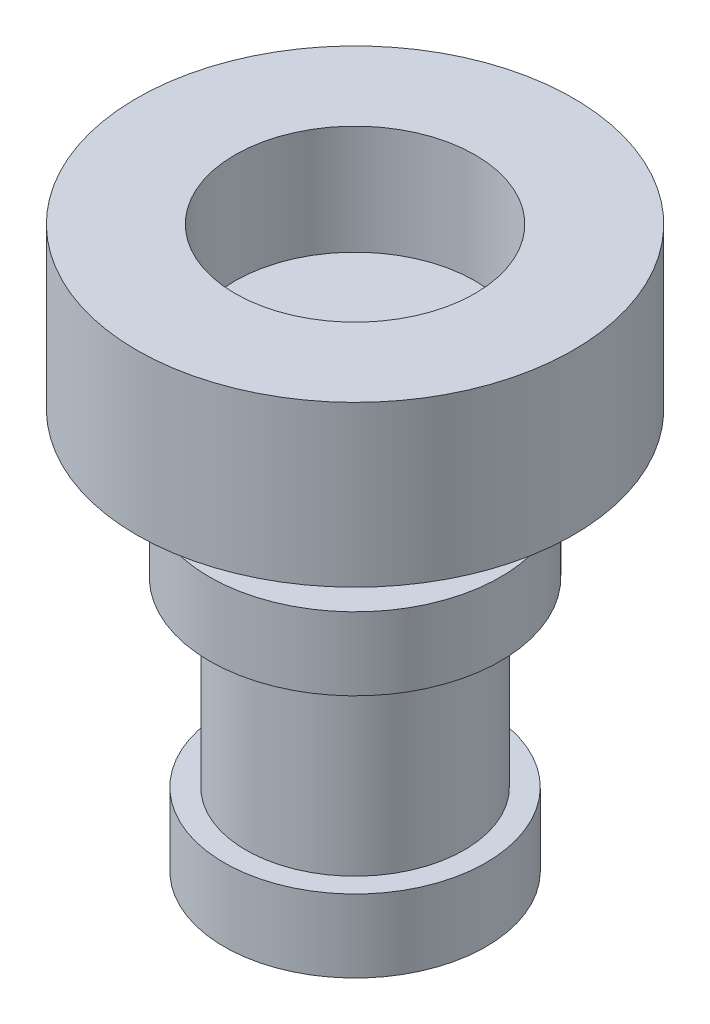
ISO-10303-21;
HEADER;
FILE_DESCRIPTION(('STEP AP214'),'2;1');
FILE_NAME('part.step','',(''),(''),'','','');
FILE_SCHEMA(('AUTOMOTIVE_DESIGN { 1 0 10303 214 1 1 1 1 }'));
ENDSEC;
DATA;
#1=APPLICATION_CONTEXT('core data for automotive mechanical design processes');
#2=APPLICATION_PROTOCOL_DEFINITION('international standard','automotive_design',2000,#1);
#3=PRODUCT_CONTEXT('',#1,'mechanical');
#4=PRODUCT('Part','Part','',(#3));
#5=PRODUCT_RELATED_PRODUCT_CATEGORY('part','',(#4));
#6=PRODUCT_DEFINITION_FORMATION('','',#4);
#7=PRODUCT_DEFINITION_CONTEXT('part definition',#1,'design');
#8=PRODUCT_DEFINITION('design','',#6,#7);
#9=PRODUCT_DEFINITION_SHAPE('','',#8);
#10=(LENGTH_UNIT() NAMED_UNIT(*) SI_UNIT(.MILLI.,.METRE.));
#11=(NAMED_UNIT(*) PLANE_ANGLE_UNIT() SI_UNIT($,.RADIAN.));
#12=(NAMED_UNIT(*) SI_UNIT($,.STERADIAN.) SOLID_ANGLE_UNIT());
#13=UNCERTAINTY_MEASURE_WITH_UNIT(LENGTH_MEASURE(1.E-05),#10,'distance_accuracy_value','');
#14=(GEOMETRIC_REPRESENTATION_CONTEXT(3) GLOBAL_UNCERTAINTY_ASSIGNED_CONTEXT((#13)) GLOBAL_UNIT_ASSIGNED_CONTEXT((#10,
#11,#12)) REPRESENTATION_CONTEXT('',''));
#15=CARTESIAN_POINT('',(0.,0.,0.));
#16=DIRECTION('',(0.,0.,1.));
#17=DIRECTION('',(1.,0.,0.));
#18=AXIS2_PLACEMENT_3D('',#15,#16,#17);
#19=CARTESIAN_POINT('',(-0.522013311509166,-5.5,-0.51113803418606));
#20=DIRECTION('',(0.,1.,0.));
#21=DIRECTION('',(0.,0.,1.));
#22=AXIS2_PLACEMENT_3D('',#19,#20,#21);
#23=CYLINDRICAL_SURFACE('',#22,1.5);
#24=CARTESIAN_POINT('',(-0.522013311509166,-2.,-0.51113803418606));
#25=DIRECTION('',(0.,-1.,0.));
#26=DIRECTION('',(0.,0.,-1.));
#27=AXIS2_PLACEMENT_3D('',#24,#25,#26);
#28=CIRCLE('',#27,1.5);
#29=CARTESIAN_POINT('',(-0.522013311509166,-2.,-2.01113803418606));
#30=VERTEX_POINT('',#29);
#31=EDGE_CURVE('E53',#30,#30,#28,.T.);
#32=ORIENTED_EDGE('',*,*,#31,.T.);
#33=EDGE_LOOP('',(#32));
#34=FACE_BOUND('',#33,.T.);
#35=CARTESIAN_POINT('',(-0.522013311509166,-4.5,-0.51113803418606));
#36=DIRECTION('',(0.,-1.,0.));
#37=DIRECTION('',(0.,0.,-1.));
#38=AXIS2_PLACEMENT_3D('',#35,#36,#37);
#39=CIRCLE('',#38,1.5);
#40=CARTESIAN_POINT('',(-0.522013311509166,-4.5,-2.01113803418606));
#41=VERTEX_POINT('',#40);
#42=EDGE_CURVE('E10',#41,#41,#39,.T.);
#43=ORIENTED_EDGE('',*,*,#42,.F.);
#44=EDGE_LOOP('',(#43));
#45=FACE_BOUND('',#44,.T.);
#46=ADVANCED_FACE('F45',(#34,#45),#23,.T.);
#47=CARTESIAN_POINT('',(-0.522013311509166,2.2,-0.51113803418606));
#48=DIRECTION('',(0.,-1.,0.));
#49=DIRECTION('',(0.,0.,-1.));
#50=AXIS2_PLACEMENT_3D('',#47,#48,#49);
#51=CYLINDRICAL_SURFACE('',#50,3.);
#52=CARTESIAN_POINT('',(-0.522013311509166,2.2,-0.51113803418606));
#53=DIRECTION('',(0.,1.,0.));
#54=DIRECTION('',(0.,0.,1.));
#55=AXIS2_PLACEMENT_3D('',#52,#53,#54);
#56=CIRCLE('',#55,3.);
#57=CARTESIAN_POINT('',(-0.522013311509166,2.2,2.48886196581394));
#58=VERTEX_POINT('',#57);
#59=EDGE_CURVE('E64',#58,#58,#56,.T.);
#60=ORIENTED_EDGE('',*,*,#59,.F.);
#61=EDGE_LOOP('',(#60));
#62=FACE_BOUND('',#61,.T.);
#63=CARTESIAN_POINT('',(-0.522013311509166,0.,-0.51113803418606));
#64=DIRECTION('',(0.,1.,0.));
#65=DIRECTION('',(0.,0.,1.));
#66=AXIS2_PLACEMENT_3D('',#63,#64,#65);
#67=CIRCLE('',#66,3.);
#68=CARTESIAN_POINT('',(-0.522013311509166,0.,2.48886196581394));
#69=VERTEX_POINT('',#68);
#70=EDGE_CURVE('E82',#69,#69,#67,.T.);
#71=ORIENTED_EDGE('',*,*,#70,.T.);
#72=EDGE_LOOP('',(#71));
#73=FACE_BOUND('',#72,.T.);
#74=ADVANCED_FACE('F47',(#62,#73),#51,.T.);
#75=CARTESIAN_POINT('',(-0.522013311509166,2.2,-0.51113803418606));
#76=DIRECTION('',(0.,1.,0.));
#77=DIRECTION('',(0.,0.,1.));
#78=AXIS2_PLACEMENT_3D('',#75,#76,#77);
#79=PLANE('',#78);
#80=CARTESIAN_POINT('',(-0.522013311509166,2.2,-0.51113803418606));
#81=DIRECTION('',(0.,1.,0.));
#82=DIRECTION('',(0.,0.,1.));
#83=AXIS2_PLACEMENT_3D('',#80,#81,#82);
#84=CIRCLE('',#83,1.65);
#85=CARTESIAN_POINT('',(-0.522013311509166,2.2,1.13886196581394));
#86=VERTEX_POINT('',#85);
#87=EDGE_CURVE('E255',#86,#86,#84,.T.);
#88=ORIENTED_EDGE('',*,*,#87,.F.);
#89=EDGE_LOOP('',(#88));
#90=FACE_BOUND('',#89,.T.);
#91=ORIENTED_EDGE('',*,*,#59,.T.);
#92=EDGE_LOOP('',(#91));
#93=FACE_BOUND('',#92,.T.);
#94=ADVANCED_FACE('F94',(#90,#93),#79,.T.);
#95=CARTESIAN_POINT('',(-0.522013311509166,0.,-0.51113803418606));
#96=DIRECTION('',(0.,1.,0.));
#97=DIRECTION('',(0.,0.,1.));
#98=AXIS2_PLACEMENT_3D('',#95,#96,#97);
#99=PLANE('',#98);
#100=CARTESIAN_POINT('',(-0.522013311509166,0.,-0.51113803418606));
#101=DIRECTION('',(0.,-1.,0.));
#102=DIRECTION('',(0.,0.,-1.));
#103=AXIS2_PLACEMENT_3D('',#100,#101,#102);
#104=CIRCLE('',#103,1.5);
#105=CARTESIAN_POINT('',(-0.522013311509166,0.,-2.01113803418606));
#106=VERTEX_POINT('',#105);
#107=EDGE_CURVE('E58',#106,#106,#104,.T.);
#108=ORIENTED_EDGE('',*,*,#107,.F.);
#109=EDGE_LOOP('',(#108));
#110=FACE_BOUND('',#109,.T.);
#111=ORIENTED_EDGE('',*,*,#70,.F.);
#112=EDGE_LOOP('',(#111));
#113=FACE_BOUND('',#112,.T.);
#114=ADVANCED_FACE('F91',(#110,#113),#99,.F.);
#115=CARTESIAN_POINT('',(-0.522013311509166,-1.,-0.51113803418606));
#116=DIRECTION('',(0.,1.,0.));
#117=DIRECTION('',(0.,0.,1.));
#118=AXIS2_PLACEMENT_3D('',#115,#116,#117);
#119=CYLINDRICAL_SURFACE('',#118,1.5);
#120=CARTESIAN_POINT('',(-0.522013311509166,-1.,-0.51113803418606));
#121=DIRECTION('',(0.,-1.,0.));
#122=DIRECTION('',(0.,0.,-1.));
#123=AXIS2_PLACEMENT_3D('',#120,#121,#122);
#124=CIRCLE('',#123,1.5);
#125=CARTESIAN_POINT('',(-0.522013311509166,-1.,-2.01113803418606));
#126=VERTEX_POINT('',#125);
#127=EDGE_CURVE('E74',#126,#126,#124,.T.);
#128=ORIENTED_EDGE('',*,*,#127,.F.);
#129=EDGE_LOOP('',(#128));
#130=FACE_BOUND('',#129,.T.);
#131=ORIENTED_EDGE('',*,*,#107,.T.);
#132=EDGE_LOOP('',(#131));
#133=FACE_BOUND('',#132,.T.);
#134=ADVANCED_FACE('F93',(#130,#133),#119,.T.);
#135=CARTESIAN_POINT('',(-0.522013311509166,-2.,-0.51113803418606));
#136=DIRECTION('',(0.,1.,0.));
#137=DIRECTION('',(0.,0.,1.));
#138=AXIS2_PLACEMENT_3D('',#135,#136,#137);
#139=CYLINDRICAL_SURFACE('',#138,2.);
#140=CARTESIAN_POINT('',(-0.522013311509166,-2.,-0.51113803418606));
#141=DIRECTION('',(0.,-1.,0.));
#142=DIRECTION('',(0.,0.,-1.));
#143=AXIS2_PLACEMENT_3D('',#140,#141,#142);
#144=CIRCLE('',#143,2.);
#145=CARTESIAN_POINT('',(-0.522013311509166,-2.,-2.51113803418606));
#146=VERTEX_POINT('',#145);
#147=EDGE_CURVE('E70',#146,#146,#144,.T.);
#148=ORIENTED_EDGE('',*,*,#147,.F.);
#149=EDGE_LOOP('',(#148));
#150=FACE_BOUND('',#149,.T.);
#151=CARTESIAN_POINT('',(-0.522013311509166,-1.,-0.51113803418606));
#152=DIRECTION('',(0.,-1.,0.));
#153=DIRECTION('',(0.,0.,-1.));
#154=AXIS2_PLACEMENT_3D('',#151,#152,#153);
#155=CIRCLE('',#154,2.);
#156=CARTESIAN_POINT('',(-0.522013311509166,-1.,-2.51113803418606));
#157=VERTEX_POINT('',#156);
#158=EDGE_CURVE('E75',#157,#157,#155,.T.);
#159=ORIENTED_EDGE('',*,*,#158,.T.);
#160=EDGE_LOOP('',(#159));
#161=FACE_BOUND('',#160,.T.);
#162=ADVANCED_FACE('F100',(#150,#161),#139,.T.);
#163=CARTESIAN_POINT('',(-0.522013311509166,-2.,-0.51113803418606));
#164=DIRECTION('',(0.,-1.,0.));
#165=DIRECTION('',(0.,0.,-1.));
#166=AXIS2_PLACEMENT_3D('',#163,#164,#165);
#167=PLANE('',#166);
#168=ORIENTED_EDGE('',*,*,#31,.F.);
#169=EDGE_LOOP('',(#168));
#170=FACE_BOUND('',#169,.T.);
#171=ORIENTED_EDGE('',*,*,#147,.T.);
#172=EDGE_LOOP('',(#171));
#173=FACE_BOUND('',#172,.T.);
#174=ADVANCED_FACE('F117',(#170,#173),#167,.T.);
#175=CARTESIAN_POINT('',(-0.522013311509166,-1.,-0.51113803418606));
#176=DIRECTION('',(0.,-1.,0.));
#177=DIRECTION('',(0.,0.,-1.));
#178=AXIS2_PLACEMENT_3D('',#175,#176,#177);
#179=PLANE('',#178);
#180=ORIENTED_EDGE('',*,*,#127,.T.);
#181=EDGE_LOOP('',(#180));
#182=FACE_BOUND('',#181,.T.);
#183=ORIENTED_EDGE('',*,*,#158,.F.);
#184=EDGE_LOOP('',(#183));
#185=FACE_BOUND('',#184,.T.);
#186=ADVANCED_FACE('F120',(#182,#185),#179,.F.);
#187=CARTESIAN_POINT('',(-0.522013311509166,-4.5,-0.51113803418606));
#188=DIRECTION('',(0.,-1.,0.));
#189=DIRECTION('',(0.,0.,-1.));
#190=AXIS2_PLACEMENT_3D('',#187,#188,#189);
#191=CYLINDRICAL_SURFACE('',#190,1.8);
#192=CARTESIAN_POINT('',(-0.522013311509166,-4.5,-0.51113803418606));
#193=DIRECTION('',(0.,-1.,0.));
#194=DIRECTION('',(0.,0.,-1.));
#195=AXIS2_PLACEMENT_3D('',#192,#193,#194);
#196=CIRCLE('',#195,1.8);
#197=CARTESIAN_POINT('',(-0.522013311509166,-4.5,-2.31113803418606));
#198=VERTEX_POINT('',#197);
#199=EDGE_CURVE('E79',#198,#198,#196,.T.);
#200=ORIENTED_EDGE('',*,*,#199,.T.);
#201=EDGE_LOOP('',(#200));
#202=FACE_BOUND('',#201,.T.);
#203=CARTESIAN_POINT('',(-0.522013311509166,-5.5,-0.51113803418606));
#204=DIRECTION('',(0.,-1.,0.));
#205=DIRECTION('',(0.,0.,-1.));
#206=AXIS2_PLACEMENT_3D('',#203,#204,#205);
#207=CIRCLE('',#206,1.8);
#208=CARTESIAN_POINT('',(-0.522013311509166,-5.5,-2.31113803418606));
#209=VERTEX_POINT('',#208);
#210=EDGE_CURVE('E68',#209,#209,#207,.T.);
#211=ORIENTED_EDGE('',*,*,#210,.F.);
#212=EDGE_LOOP('',(#211));
#213=FACE_BOUND('',#212,.T.);
#214=ADVANCED_FACE('F124',(#202,#213),#191,.T.);
#215=CARTESIAN_POINT('',(-0.522013311509166,-4.5,-0.51113803418606));
#216=DIRECTION('',(0.,-1.,0.));
#217=DIRECTION('',(0.,0.,-1.));
#218=AXIS2_PLACEMENT_3D('',#215,#216,#217);
#219=PLANE('',#218);
#220=ORIENTED_EDGE('',*,*,#42,.T.);
#221=EDGE_LOOP('',(#220));
#222=FACE_BOUND('',#221,.T.);
#223=ORIENTED_EDGE('',*,*,#199,.F.);
#224=EDGE_LOOP('',(#223));
#225=FACE_BOUND('',#224,.T.);
#226=ADVANCED_FACE('F151',(#222,#225),#219,.F.);
#227=CARTESIAN_POINT('',(-0.522013311509166,-5.5,-0.51113803418606));
#228=DIRECTION('',(0.,-1.,0.));
#229=DIRECTION('',(0.,0.,-1.));
#230=AXIS2_PLACEMENT_3D('',#227,#228,#229);
#231=PLANE('',#230);
#232=ORIENTED_EDGE('',*,*,#210,.T.);
#233=EDGE_LOOP('',(#232));
#234=FACE_BOUND('',#233,.T.);
#235=ADVANCED_FACE('F115',(#234),#231,.T.);
#236=CARTESIAN_POINT('',(-0.522013311509166,0.7,-0.51113803418606));
#237=DIRECTION('',(0.,1.,0.));
#238=DIRECTION('',(0.,0.,1.));
#239=AXIS2_PLACEMENT_3D('',#236,#237,#238);
#240=CYLINDRICAL_SURFACE('',#239,1.65);
#241=CARTESIAN_POINT('',(-0.522013311509166,0.7,-0.51113803418606));
#242=DIRECTION('',(0.,1.,0.));
#243=DIRECTION('',(0.,0.,1.));
#244=AXIS2_PLACEMENT_3D('',#241,#242,#243);
#245=CIRCLE('',#244,1.65);
#246=CARTESIAN_POINT('',(-0.522013311509166,0.7,1.13886196581394));
#247=VERTEX_POINT('',#246);
#248=EDGE_CURVE('E253',#247,#247,#245,.T.);
#249=ORIENTED_EDGE('',*,*,#248,.F.);
#250=EDGE_LOOP('',(#249));
#251=FACE_BOUND('',#250,.T.);
#252=ORIENTED_EDGE('',*,*,#87,.T.);
#253=EDGE_LOOP('',(#252));
#254=FACE_BOUND('',#253,.T.);
#255=ADVANCED_FACE('F164',(#251,#254),#240,.F.);
#256=CARTESIAN_POINT('',(-0.522013311509166,0.7,-0.51113803418606));
#257=DIRECTION('',(0.,1.,0.));
#258=DIRECTION('',(0.,0.,1.));
#259=AXIS2_PLACEMENT_3D('',#256,#257,#258);
#260=PLANE('',#259);
#261=ORIENTED_EDGE('',*,*,#248,.T.);
#262=EDGE_LOOP('',(#261));
#263=FACE_BOUND('',#262,.T.);
#264=ADVANCED_FACE('F172',(#263),#260,.T.);
#265=CLOSED_SHELL('',(#46,#74,#94,#114,#134,#162,#174,#186,#214,#226,#235,#255,#264));
#266=MANIFOLD_SOLID_BREP('B2',#265);
#267=ADVANCED_BREP_SHAPE_REPRESENTATION('',(#18,#266),#14);
#268=SHAPE_DEFINITION_REPRESENTATION(#9,#267);
ENDSEC;
END-ISO-10303-21;
